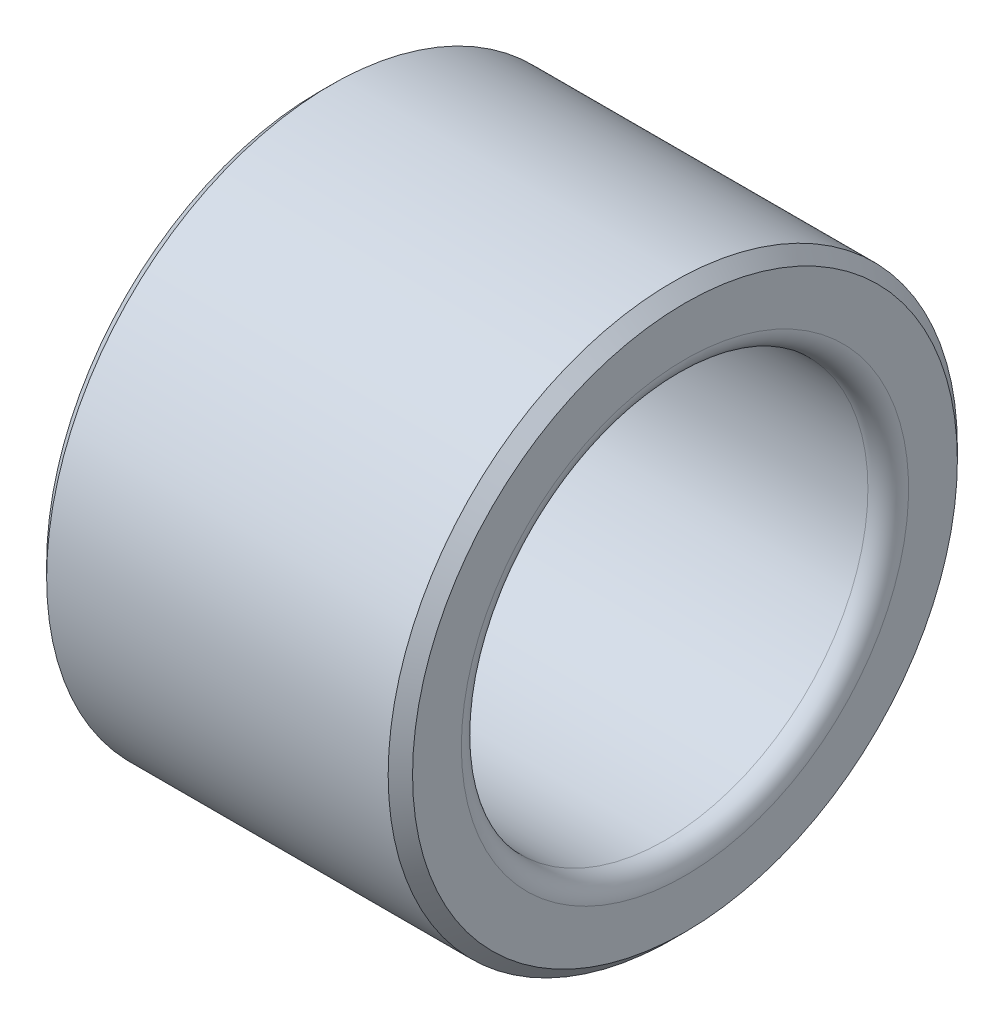
ISO-10303-21;
HEADER;
FILE_DESCRIPTION(('STEP AP214'),'2;1');
FILE_NAME('part.step','',(''),(''),'','','');
FILE_SCHEMA(('AUTOMOTIVE_DESIGN { 1 0 10303 214 1 1 1 1 }'));
ENDSEC;
DATA;
#1=APPLICATION_CONTEXT('core data for automotive mechanical design processes');
#2=APPLICATION_PROTOCOL_DEFINITION('international standard','automotive_design',2000,#1);
#3=PRODUCT_CONTEXT('',#1,'mechanical');
#4=PRODUCT('Part','Part','',(#3));
#5=PRODUCT_RELATED_PRODUCT_CATEGORY('part','',(#4));
#6=PRODUCT_DEFINITION_FORMATION('','',#4);
#7=PRODUCT_DEFINITION_CONTEXT('part definition',#1,'design');
#8=PRODUCT_DEFINITION('design','',#6,#7);
#9=PRODUCT_DEFINITION_SHAPE('','',#8);
#10=(LENGTH_UNIT() NAMED_UNIT(*) SI_UNIT(.MILLI.,.METRE.));
#11=(NAMED_UNIT(*) PLANE_ANGLE_UNIT() SI_UNIT($,.RADIAN.));
#12=(NAMED_UNIT(*) SI_UNIT($,.STERADIAN.) SOLID_ANGLE_UNIT());
#13=UNCERTAINTY_MEASURE_WITH_UNIT(LENGTH_MEASURE(1.E-05),#10,'distance_accuracy_value','');
#14=(GEOMETRIC_REPRESENTATION_CONTEXT(3) GLOBAL_UNCERTAINTY_ASSIGNED_CONTEXT((#13)) GLOBAL_UNIT_ASSIGNED_CONTEXT((#10,
#11,#12)) REPRESENTATION_CONTEXT('',''));
#15=CARTESIAN_POINT('',(0.,0.,0.));
#16=DIRECTION('',(0.,0.,1.));
#17=DIRECTION('',(1.,0.,0.));
#18=AXIS2_PLACEMENT_3D('',#15,#16,#17);
#19=CARTESIAN_POINT('',(-4.5,5.,0.));
#20=DIRECTION('',(1.,0.,0.));
#21=DIRECTION('',(0.,0.,-1.));
#22=AXIS2_PLACEMENT_3D('',#19,#20,#21);
#23=PLANE('',#22);
#24=CARTESIAN_POINT('',(-4.5,0.,0.));
#25=DIRECTION('',(1.,0.,0.));
#26=DIRECTION('',(0.,0.,-1.));
#27=AXIS2_PLACEMENT_3D('',#24,#25,#26);
#28=CIRCLE('',#27,5.5);
#29=CARTESIAN_POINT('',(-4.5,0.,-5.5));
#30=VERTEX_POINT('',#29);
#31=EDGE_CURVE('E40',#30,#30,#28,.T.);
#32=ORIENTED_EDGE('',*,*,#31,.T.);
#33=EDGE_LOOP('',(#32));
#34=FACE_BOUND('',#33,.T.);
#35=CARTESIAN_POINT('',(-4.5,0.,0.));
#36=DIRECTION('',(1.,0.,0.));
#37=DIRECTION('',(0.,0.,-1.));
#38=AXIS2_PLACEMENT_3D('',#35,#36,#37);
#39=CIRCLE('',#38,6.7);
#40=CARTESIAN_POINT('',(-4.5,0.,-6.7));
#41=VERTEX_POINT('',#40);
#42=EDGE_CURVE('E62',#41,#41,#39,.F.);
#43=ORIENTED_EDGE('',*,*,#42,.T.);
#44=EDGE_LOOP('',(#43));
#45=FACE_BOUND('',#44,.T.);
#46=ADVANCED_FACE('F33',(#34,#45),#23,.F.);
#47=CARTESIAN_POINT('',(-51.5237272289989,0.,0.));
#48=DIRECTION('',(-1.,0.,0.));
#49=DIRECTION('',(0.,0.,1.));
#50=AXIS2_PLACEMENT_3D('',#47,#48,#49);
#51=CYLINDRICAL_SURFACE('',#50,7.);
#52=CARTESIAN_POINT('',(-4.2,0.,0.));
#53=DIRECTION('',(1.,0.,0.));
#54=DIRECTION('',(0.,0.,-1.));
#55=AXIS2_PLACEMENT_3D('',#52,#53,#54);
#56=CIRCLE('',#55,7.);
#57=CARTESIAN_POINT('',(-4.2,0.,-7.));
#58=VERTEX_POINT('',#57);
#59=EDGE_CURVE('E56',#58,#58,#56,.T.);
#60=ORIENTED_EDGE('',*,*,#59,.T.);
#61=EDGE_LOOP('',(#60));
#62=FACE_BOUND('',#61,.T.);
#63=CARTESIAN_POINT('',(4.2,0.,0.));
#64=DIRECTION('',(-1.,0.,0.));
#65=DIRECTION('',(0.,0.,1.));
#66=AXIS2_PLACEMENT_3D('',#63,#64,#65);
#67=CIRCLE('',#66,7.);
#68=CARTESIAN_POINT('',(4.2,0.,7.));
#69=VERTEX_POINT('',#68);
#70=EDGE_CURVE('E59',#69,#69,#67,.T.);
#71=ORIENTED_EDGE('',*,*,#70,.T.);
#72=EDGE_LOOP('',(#71));
#73=FACE_BOUND('',#72,.T.);
#74=ADVANCED_FACE('F87',(#62,#73),#51,.T.);
#75=CARTESIAN_POINT('',(4.5,5.,0.));
#76=DIRECTION('',(-1.,0.,0.));
#77=DIRECTION('',(0.,0.,1.));
#78=AXIS2_PLACEMENT_3D('',#75,#76,#77);
#79=PLANE('',#78);
#80=CARTESIAN_POINT('',(4.5,0.,0.));
#81=DIRECTION('',(-1.,0.,0.));
#82=DIRECTION('',(0.,0.,1.));
#83=AXIS2_PLACEMENT_3D('',#80,#81,#82);
#84=CIRCLE('',#83,5.5);
#85=CARTESIAN_POINT('',(4.5,0.,5.5));
#86=VERTEX_POINT('',#85);
#87=EDGE_CURVE('E10',#86,#86,#84,.T.);
#88=ORIENTED_EDGE('',*,*,#87,.T.);
#89=EDGE_LOOP('',(#88));
#90=FACE_BOUND('',#89,.T.);
#91=CARTESIAN_POINT('',(4.5,0.,0.));
#92=DIRECTION('',(-1.,0.,0.));
#93=DIRECTION('',(0.,0.,1.));
#94=AXIS2_PLACEMENT_3D('',#91,#92,#93);
#95=CIRCLE('',#94,6.7);
#96=CARTESIAN_POINT('',(4.5,0.,6.7));
#97=VERTEX_POINT('',#96);
#98=EDGE_CURVE('E53',#97,#97,#95,.F.);
#99=ORIENTED_EDGE('',*,*,#98,.T.);
#100=EDGE_LOOP('',(#99));
#101=FACE_BOUND('',#100,.T.);
#102=ADVANCED_FACE('F80',(#90,#101),#79,.F.);
#103=CARTESIAN_POINT('',(-51.5237272289989,0.,0.));
#104=DIRECTION('',(-1.,0.,0.));
#105=DIRECTION('',(0.,0.,1.));
#106=AXIS2_PLACEMENT_3D('',#103,#104,#105);
#107=CYLINDRICAL_SURFACE('',#106,5.);
#108=CARTESIAN_POINT('',(-4.,0.,0.));
#109=DIRECTION('',(1.,0.,0.));
#110=DIRECTION('',(0.,0.,-1.));
#111=AXIS2_PLACEMENT_3D('',#108,#109,#110);
#112=CIRCLE('',#111,5.);
#113=CARTESIAN_POINT('',(-4.,0.,-5.));
#114=VERTEX_POINT('',#113);
#115=EDGE_CURVE('E44',#114,#114,#112,.F.);
#116=ORIENTED_EDGE('',*,*,#115,.T.);
#117=EDGE_LOOP('',(#116));
#118=FACE_BOUND('',#117,.T.);
#119=CARTESIAN_POINT('',(4.,0.,0.));
#120=DIRECTION('',(-1.,0.,0.));
#121=DIRECTION('',(0.,0.,1.));
#122=AXIS2_PLACEMENT_3D('',#119,#120,#121);
#123=CIRCLE('',#122,5.);
#124=CARTESIAN_POINT('',(4.,0.,5.));
#125=VERTEX_POINT('',#124);
#126=EDGE_CURVE('E48',#125,#125,#123,.F.);
#127=ORIENTED_EDGE('',*,*,#126,.T.);
#128=EDGE_LOOP('',(#127));
#129=FACE_BOUND('',#128,.T.);
#130=ADVANCED_FACE('F70',(#118,#129),#107,.F.);
#131=CARTESIAN_POINT('',(-4.5,0.,0.));
#132=DIRECTION('',(1.,0.,0.));
#133=DIRECTION('',(0.,0.,-1.));
#134=AXIS2_PLACEMENT_3D('',#131,#132,#133);
#135=CONICAL_SURFACE('',#134,6.7,0.78539816339745);
#136=ORIENTED_EDGE('',*,*,#59,.F.);
#137=EDGE_LOOP('',(#136));
#138=FACE_BOUND('',#137,.T.);
#139=ORIENTED_EDGE('',*,*,#42,.F.);
#140=EDGE_LOOP('',(#139));
#141=FACE_BOUND('',#140,.T.);
#142=ADVANCED_FACE('F67',(#138,#141),#135,.T.);
#143=CARTESIAN_POINT('',(4.2,0.,0.));
#144=DIRECTION('',(-1.,0.,0.));
#145=DIRECTION('',(0.,0.,1.));
#146=AXIS2_PLACEMENT_3D('',#143,#144,#145);
#147=CONICAL_SURFACE('',#146,7.,0.785398163397447);
#148=ORIENTED_EDGE('',*,*,#98,.F.);
#149=EDGE_LOOP('',(#148));
#150=FACE_BOUND('',#149,.T.);
#151=ORIENTED_EDGE('',*,*,#70,.F.);
#152=EDGE_LOOP('',(#151));
#153=FACE_BOUND('',#152,.T.);
#154=ADVANCED_FACE('F69',(#150,#153),#147,.T.);
#155=CARTESIAN_POINT('',(-4.,0.,0.));
#156=DIRECTION('',(1.,0.,0.));
#157=DIRECTION('',(0.,0.,-1.));
#158=AXIS2_PLACEMENT_3D('',#155,#156,#157);
#159=TOROIDAL_SURFACE('',#158,5.5,0.5);
#160=ORIENTED_EDGE('',*,*,#31,.F.);
#161=EDGE_LOOP('',(#160));
#162=FACE_BOUND('',#161,.T.);
#163=ORIENTED_EDGE('',*,*,#115,.F.);
#164=EDGE_LOOP('',(#163));
#165=FACE_BOUND('',#164,.T.);
#166=ADVANCED_FACE('F77',(#162,#165),#159,.T.);
#167=CARTESIAN_POINT('',(4.,0.,0.));
#168=DIRECTION('',(-1.,0.,0.));
#169=DIRECTION('',(0.,0.,1.));
#170=AXIS2_PLACEMENT_3D('',#167,#168,#169);
#171=TOROIDAL_SURFACE('',#170,5.5,0.5);
#172=ORIENTED_EDGE('',*,*,#126,.F.);
#173=EDGE_LOOP('',(#172));
#174=FACE_BOUND('',#173,.T.);
#175=ORIENTED_EDGE('',*,*,#87,.F.);
#176=EDGE_LOOP('',(#175));
#177=FACE_BOUND('',#176,.T.);
#178=ADVANCED_FACE('F35',(#174,#177),#171,.T.);
#179=CLOSED_SHELL('',(#46,#74,#102,#130,#142,#154,#166,#178));
#180=MANIFOLD_SOLID_BREP('B2',#179);
#181=ADVANCED_BREP_SHAPE_REPRESENTATION('',(#18,#180),#14);
#182=SHAPE_DEFINITION_REPRESENTATION(#9,#181);
ENDSEC;
END-ISO-10303-21;
